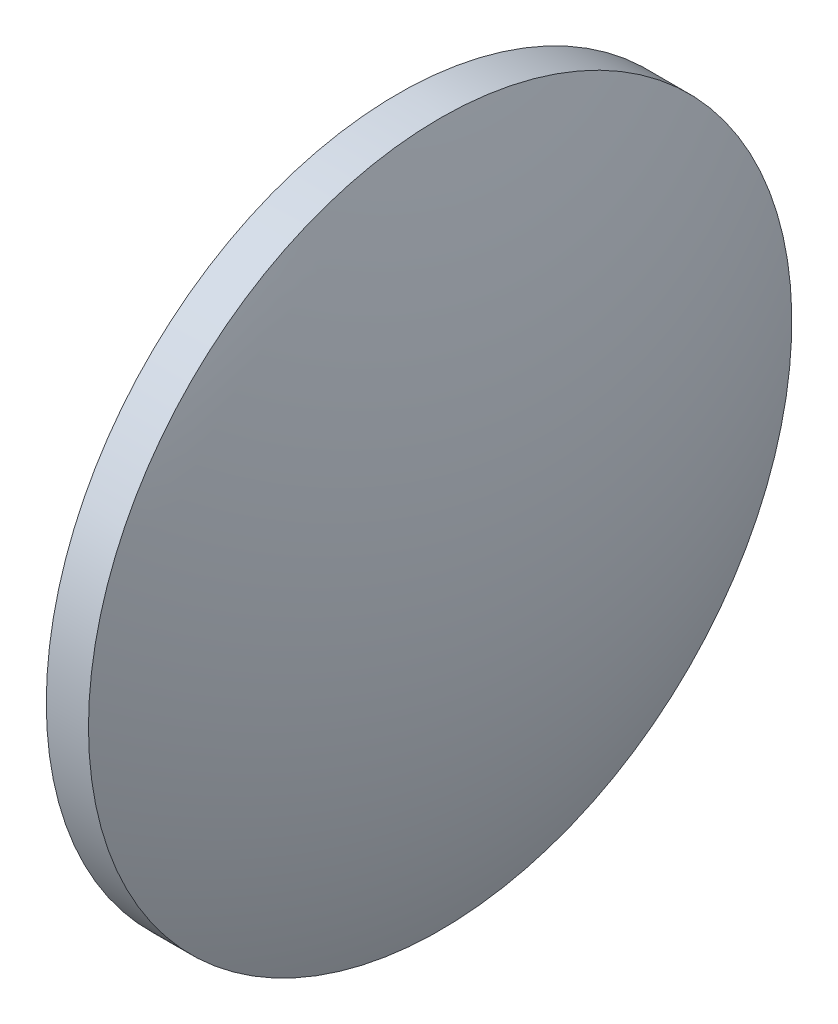
ISO-10303-21;
HEADER;
FILE_DESCRIPTION(('STEP AP214'),'2;1');
FILE_NAME('part.step','',(''),(''),'','','');
FILE_SCHEMA(('AUTOMOTIVE_DESIGN { 1 0 10303 214 1 1 1 1 }'));
ENDSEC;
DATA;
#1=APPLICATION_CONTEXT('core data for automotive mechanical design processes');
#2=APPLICATION_PROTOCOL_DEFINITION('international standard','automotive_design',2000,#1);
#3=PRODUCT_CONTEXT('',#1,'mechanical');
#4=PRODUCT('Part','Part','',(#3));
#5=PRODUCT_RELATED_PRODUCT_CATEGORY('part','',(#4));
#6=PRODUCT_DEFINITION_FORMATION('','',#4);
#7=PRODUCT_DEFINITION_CONTEXT('part definition',#1,'design');
#8=PRODUCT_DEFINITION('design','',#6,#7);
#9=PRODUCT_DEFINITION_SHAPE('','',#8);
#10=(LENGTH_UNIT() NAMED_UNIT(*) SI_UNIT(.MILLI.,.METRE.));
#11=(NAMED_UNIT(*) PLANE_ANGLE_UNIT() SI_UNIT($,.RADIAN.));
#12=(NAMED_UNIT(*) SI_UNIT($,.STERADIAN.) SOLID_ANGLE_UNIT());
#13=UNCERTAINTY_MEASURE_WITH_UNIT(LENGTH_MEASURE(1.E-05),#10,'distance_accuracy_value','');
#14=(GEOMETRIC_REPRESENTATION_CONTEXT(3) GLOBAL_UNCERTAINTY_ASSIGNED_CONTEXT((#13)) GLOBAL_UNIT_ASSIGNED_CONTEXT((#10,
#11,#12)) REPRESENTATION_CONTEXT('',''));
#15=CARTESIAN_POINT('',(0.,0.,0.));
#16=DIRECTION('',(0.,0.,1.));
#17=DIRECTION('',(1.,0.,0.));
#18=AXIS2_PLACEMENT_3D('',#15,#16,#17);
#19=CARTESIAN_POINT('',(639.54887257033,221.711816188116,0.));
#20=DIRECTION('',(-1.,0.,0.));
#21=DIRECTION('',(0.,1.,0.));
#22=AXIS2_PLACEMENT_3D('',#19,#20,#21);
#23=SPHERICAL_SURFACE('',#22,32.5);
#24=CARTESIAN_POINT('',(669.54887257033,221.711816188116,0.));
#25=DIRECTION('',(-1.,0.,0.));
#26=DIRECTION('',(0.,0.,1.));
#27=AXIS2_PLACEMENT_3D('',#24,#25,#26);
#28=CIRCLE('',#27,12.5);
#29=CARTESIAN_POINT('',(669.54887257033,221.711816188116,12.5));
#30=VERTEX_POINT('',#29);
#31=EDGE_CURVE('E10',#30,#30,#28,.T.);
#32=ORIENTED_EDGE('',*,*,#31,.F.);
#33=EDGE_LOOP('',(#32));
#34=FACE_BOUND('',#33,.T.);
#35=ADVANCED_FACE('F35',(#34),#23,.T.);
#36=CARTESIAN_POINT('',(644.580747602771,221.711816188116,0.));
#37=DIRECTION('',(-1.,0.,0.));
#38=DIRECTION('',(0.,0.,1.));
#39=AXIS2_PLACEMENT_3D('',#36,#37,#38);
#40=CYLINDRICAL_SURFACE('',#39,12.5);
#41=CARTESIAN_POINT('',(668.04887257033,221.711816188116,0.));
#42=DIRECTION('',(-1.,0.,0.));
#43=DIRECTION('',(0.,0.,1.));
#44=AXIS2_PLACEMENT_3D('',#41,#42,#43);
#45=CIRCLE('',#44,12.5);
#46=CARTESIAN_POINT('',(668.04887257033,221.711816188116,12.5));
#47=VERTEX_POINT('',#46);
#48=EDGE_CURVE('E41',#47,#47,#45,.T.);
#49=ORIENTED_EDGE('',*,*,#48,.F.);
#50=EDGE_LOOP('',(#49));
#51=FACE_BOUND('',#50,.T.);
#52=ORIENTED_EDGE('',*,*,#31,.T.);
#53=EDGE_LOOP('',(#52));
#54=FACE_BOUND('',#53,.T.);
#55=ADVANCED_FACE('F49',(#51,#54),#40,.T.);
#56=CARTESIAN_POINT('',(668.04887257033,221.711816188116,0.));
#57=DIRECTION('',(1.,0.,0.));
#58=DIRECTION('',(0.,0.,-1.));
#59=AXIS2_PLACEMENT_3D('',#56,#57,#58);
#60=PLANE('',#59);
#61=ORIENTED_EDGE('',*,*,#48,.T.);
#62=EDGE_LOOP('',(#61));
#63=FACE_BOUND('',#62,.T.);
#64=ADVANCED_FACE('F47',(#63),#60,.F.);
#65=CLOSED_SHELL('',(#35,#55,#64));
#66=MANIFOLD_SOLID_BREP('B2',#65);
#67=ADVANCED_BREP_SHAPE_REPRESENTATION('',(#18,#66),#14);
#68=SHAPE_DEFINITION_REPRESENTATION(#9,#67);
ENDSEC;
END-ISO-10303-21;
